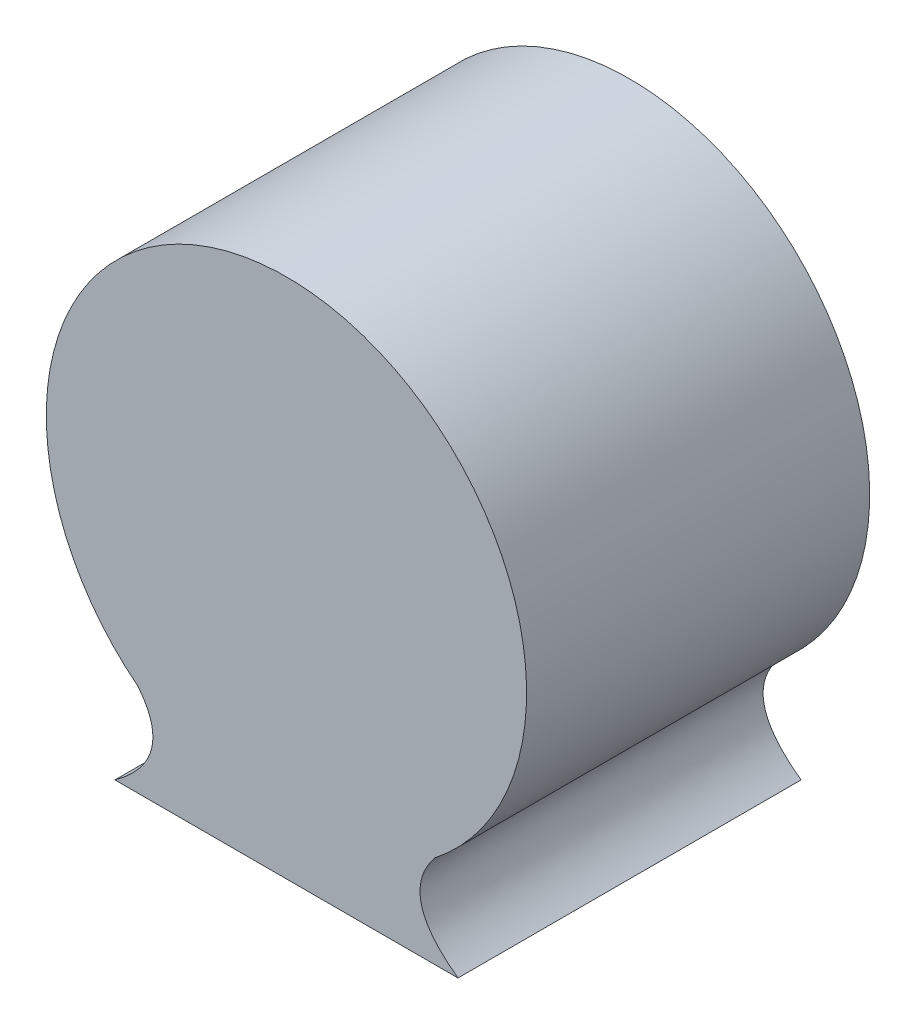
ISO-10303-21;
HEADER;
FILE_DESCRIPTION(('STEP AP214'),'2;1');
FILE_NAME('part.step','',(''),(''),'','','');
FILE_SCHEMA(('AUTOMOTIVE_DESIGN { 1 0 10303 214 1 1 1 1 }'));
ENDSEC;
DATA;
#1=APPLICATION_CONTEXT('core data for automotive mechanical design processes');
#2=APPLICATION_PROTOCOL_DEFINITION('international standard','automotive_design',2000,#1);
#3=PRODUCT_CONTEXT('',#1,'mechanical');
#4=PRODUCT('Part','Part','',(#3));
#5=PRODUCT_RELATED_PRODUCT_CATEGORY('part','',(#4));
#6=PRODUCT_DEFINITION_FORMATION('','',#4);
#7=PRODUCT_DEFINITION_CONTEXT('part definition',#1,'design');
#8=PRODUCT_DEFINITION('design','',#6,#7);
#9=PRODUCT_DEFINITION_SHAPE('','',#8);
#10=(LENGTH_UNIT() NAMED_UNIT(*) SI_UNIT(.MILLI.,.METRE.));
#11=(NAMED_UNIT(*) PLANE_ANGLE_UNIT() SI_UNIT($,.RADIAN.));
#12=(NAMED_UNIT(*) SI_UNIT($,.STERADIAN.) SOLID_ANGLE_UNIT());
#13=UNCERTAINTY_MEASURE_WITH_UNIT(LENGTH_MEASURE(1.E-05),#10,'distance_accuracy_value','');
#14=(GEOMETRIC_REPRESENTATION_CONTEXT(3) GLOBAL_UNCERTAINTY_ASSIGNED_CONTEXT((#13)) GLOBAL_UNIT_ASSIGNED_CONTEXT((#10,
#11,#12)) REPRESENTATION_CONTEXT('',''));
#15=CARTESIAN_POINT('',(0.,0.,0.));
#16=DIRECTION('',(0.,0.,1.));
#17=DIRECTION('',(1.,0.,0.));
#18=AXIS2_PLACEMENT_3D('',#15,#16,#17);
#19=CARTESIAN_POINT('',(-21.6267017488659,-27.5188257646579,50.));
#20=CARTESIAN_POINT('',(-16.0097543912661,-34.5134983298628,50.));
#21=CARTESIAN_POINT('',(-25.,-41.,50.));
#22=B_SPLINE_CURVE_WITH_KNOTS('',2,(#19,#20,#21),.UNSPECIFIED.,.F.,.F.,(3,3),(0.,1.),.UNSPECIFIED.);
#23=DIRECTION('',(0.,0.,-1.));
#24=VECTOR('',#23,1.);
#25=SURFACE_OF_LINEAR_EXTRUSION('',#22,#24);
#26=CARTESIAN_POINT('',(-21.6267017488659,-27.5188257646579,0.));
#27=CARTESIAN_POINT('',(-16.0097543912661,-34.5134983298628,0.));
#28=CARTESIAN_POINT('',(-25.,-41.,0.));
#29=B_SPLINE_CURVE_WITH_KNOTS('',2,(#26,#27,#28),.UNSPECIFIED.,.F.,.F.,(3,3),(0.,1.),.UNSPECIFIED.);
#30=CARTESIAN_POINT('',(-21.6267017488659,-27.5188257646579,0.));
#31=VERTEX_POINT('',#30);
#32=CARTESIAN_POINT('',(-25.,-41.,0.));
#33=VERTEX_POINT('',#32);
#34=EDGE_CURVE('E144',#31,#33,#29,.T.);
#35=ORIENTED_EDGE('',*,*,#34,.T.);
#36=DIRECTION('',(0.,0.,-1.));
#37=VECTOR('',#36,1.);
#38=CARTESIAN_POINT('',(-25.,-41.,50.));
#39=LINE('',#38,#37);
#40=CARTESIAN_POINT('',(-25.,-41.,50.));
#41=VERTEX_POINT('',#40);
#42=EDGE_CURVE('E12',#41,#33,#39,.T.);
#43=ORIENTED_EDGE('',*,*,#42,.F.);
#44=CARTESIAN_POINT('',(-21.6267017488659,-27.5188257646579,50.));
#45=VERTEX_POINT('',#44);
#46=EDGE_CURVE('E106',#45,#41,#22,.T.);
#47=ORIENTED_EDGE('',*,*,#46,.F.);
#48=DIRECTION('',(0.,0.,-1.));
#49=VECTOR('',#48,1.);
#50=CARTESIAN_POINT('',(-21.6267017488659,-27.5188257646579,50.));
#51=LINE('',#50,#49);
#52=EDGE_CURVE('E120',#45,#31,#51,.T.);
#53=ORIENTED_EDGE('',*,*,#52,.T.);
#54=EDGE_LOOP('',(#35,#43,#47,#53));
#55=FACE_BOUND('',#54,.T.);
#56=ADVANCED_FACE('F46',(#55),#25,.F.);
#57=CARTESIAN_POINT('',(25.,-41.,50.));
#58=DIRECTION('',(0.,1.,0.));
#59=DIRECTION('',(-1.,0.,0.));
#60=AXIS2_PLACEMENT_3D('',#57,#58,#59);
#61=PLANE('',#60);
#62=DIRECTION('',(1.,0.,0.));
#63=VECTOR('',#62,1.);
#64=CARTESIAN_POINT('',(25.,-41.,0.));
#65=LINE('',#64,#63);
#66=CARTESIAN_POINT('',(25.,-41.,0.));
#67=VERTEX_POINT('',#66);
#68=EDGE_CURVE('E111',#33,#67,#65,.T.);
#69=ORIENTED_EDGE('',*,*,#68,.T.);
#70=DIRECTION('',(0.,0.,-1.));
#71=VECTOR('',#70,1.);
#72=CARTESIAN_POINT('',(25.,-41.,50.));
#73=LINE('',#72,#71);
#74=CARTESIAN_POINT('',(25.,-41.,50.));
#75=VERTEX_POINT('',#74);
#76=EDGE_CURVE('E55',#75,#67,#73,.T.);
#77=ORIENTED_EDGE('',*,*,#76,.F.);
#78=DIRECTION('',(1.,0.,0.));
#79=VECTOR('',#78,1.);
#80=CARTESIAN_POINT('',(25.,-41.,50.));
#81=LINE('',#80,#79);
#82=EDGE_CURVE('E101',#41,#75,#81,.T.);
#83=ORIENTED_EDGE('',*,*,#82,.F.);
#84=ORIENTED_EDGE('',*,*,#42,.T.);
#85=EDGE_LOOP('',(#69,#77,#83,#84));
#86=FACE_BOUND('',#85,.T.);
#87=ADVANCED_FACE('F110',(#86),#61,.F.);
#88=CARTESIAN_POINT('',(25.,-41.,50.));
#89=CARTESIAN_POINT('',(16.0097543912661,-34.5134983298627,50.));
#90=CARTESIAN_POINT('',(21.6267017488659,-27.5188257646579,50.));
#91=B_SPLINE_CURVE_WITH_KNOTS('',2,(#88,#89,#90),.UNSPECIFIED.,.F.,.F.,(3,3),(0.,1.),.UNSPECIFIED.);
#92=DIRECTION('',(0.,0.,-1.));
#93=VECTOR('',#92,1.);
#94=SURFACE_OF_LINEAR_EXTRUSION('',#91,#93);
#95=CARTESIAN_POINT('',(25.,-41.,0.));
#96=CARTESIAN_POINT('',(16.0097543912661,-34.5134983298627,0.));
#97=CARTESIAN_POINT('',(21.6267017488659,-27.5188257646579,0.));
#98=B_SPLINE_CURVE_WITH_KNOTS('',2,(#95,#96,#97),.UNSPECIFIED.,.F.,.F.,(3,3),(0.,1.),.UNSPECIFIED.);
#99=CARTESIAN_POINT('',(21.6267017488659,-27.5188257646579,0.));
#100=VERTEX_POINT('',#99);
#101=EDGE_CURVE('E86',#67,#100,#98,.T.);
#102=ORIENTED_EDGE('',*,*,#101,.T.);
#103=DIRECTION('',(0.,0.,-1.));
#104=VECTOR('',#103,1.);
#105=CARTESIAN_POINT('',(21.6267017488659,-27.5188257646579,50.));
#106=LINE('',#105,#104);
#107=CARTESIAN_POINT('',(21.6267017488659,-27.5188257646579,50.));
#108=VERTEX_POINT('',#107);
#109=EDGE_CURVE('E113',#108,#100,#106,.T.);
#110=ORIENTED_EDGE('',*,*,#109,.F.);
#111=EDGE_CURVE('E104',#75,#108,#91,.T.);
#112=ORIENTED_EDGE('',*,*,#111,.F.);
#113=ORIENTED_EDGE('',*,*,#76,.T.);
#114=EDGE_LOOP('',(#102,#110,#112,#113));
#115=FACE_BOUND('',#114,.T.);
#116=ADVANCED_FACE('F114',(#115),#94,.F.);
#117=CARTESIAN_POINT('',(0.,0.,50.));
#118=DIRECTION('',(0.,0.,-1.));
#119=DIRECTION('',(-1.,0.,0.));
#120=AXIS2_PLACEMENT_3D('',#117,#118,#119);
#121=CYLINDRICAL_SURFACE('',#120,35.);
#122=CARTESIAN_POINT('',(0.,0.,0.));
#123=DIRECTION('',(0.,0.,1.));
#124=DIRECTION('',(1.,0.,0.));
#125=AXIS2_PLACEMENT_3D('',#122,#123,#124);
#126=CIRCLE('',#125,35.);
#127=EDGE_CURVE('E93',#100,#31,#126,.T.);
#128=ORIENTED_EDGE('',*,*,#127,.T.);
#129=ORIENTED_EDGE('',*,*,#52,.F.);
#130=CARTESIAN_POINT('',(0.,0.,50.));
#131=DIRECTION('',(0.,0.,1.));
#132=DIRECTION('',(1.,0.,0.));
#133=AXIS2_PLACEMENT_3D('',#130,#131,#132);
#134=CIRCLE('',#133,35.);
#135=EDGE_CURVE('E66',#108,#45,#134,.T.);
#136=ORIENTED_EDGE('',*,*,#135,.F.);
#137=ORIENTED_EDGE('',*,*,#109,.T.);
#138=EDGE_LOOP('',(#128,#129,#136,#137));
#139=FACE_BOUND('',#138,.T.);
#140=ADVANCED_FACE('F133',(#139),#121,.T.);
#141=CARTESIAN_POINT('',(-19.6615526328495,-34.3864556060959,50.));
#142=DIRECTION('',(0.,0.,-1.));
#143=DIRECTION('',(-1.,0.,0.));
#144=AXIS2_PLACEMENT_3D('',#141,#142,#143);
#145=PLANE('',#144);
#146=ORIENTED_EDGE('',*,*,#46,.T.);
#147=ORIENTED_EDGE('',*,*,#82,.T.);
#148=ORIENTED_EDGE('',*,*,#111,.T.);
#149=ORIENTED_EDGE('',*,*,#135,.T.);
#150=EDGE_LOOP('',(#146,#147,#148,#149));
#151=FACE_BOUND('',#150,.T.);
#152=ADVANCED_FACE('F102',(#151),#145,.F.);
#153=CARTESIAN_POINT('',(-19.6615526328495,-34.3864556060959,0.));
#154=DIRECTION('',(0.,0.,-1.));
#155=DIRECTION('',(-1.,0.,0.));
#156=AXIS2_PLACEMENT_3D('',#153,#154,#155);
#157=PLANE('',#156);
#158=ORIENTED_EDGE('',*,*,#34,.F.);
#159=ORIENTED_EDGE('',*,*,#127,.F.);
#160=ORIENTED_EDGE('',*,*,#101,.F.);
#161=ORIENTED_EDGE('',*,*,#68,.F.);
#162=EDGE_LOOP('',(#158,#159,#160,#161));
#163=FACE_BOUND('',#162,.T.);
#164=ADVANCED_FACE('F166',(#163),#157,.T.);
#165=CLOSED_SHELL('',(#56,#87,#116,#140,#152,#164));
#166=MANIFOLD_SOLID_BREP('B2',#165);
#167=ADVANCED_BREP_SHAPE_REPRESENTATION('',(#18,#166),#14);
#168=SHAPE_DEFINITION_REPRESENTATION(#9,#167);
ENDSEC;
END-ISO-10303-21;
